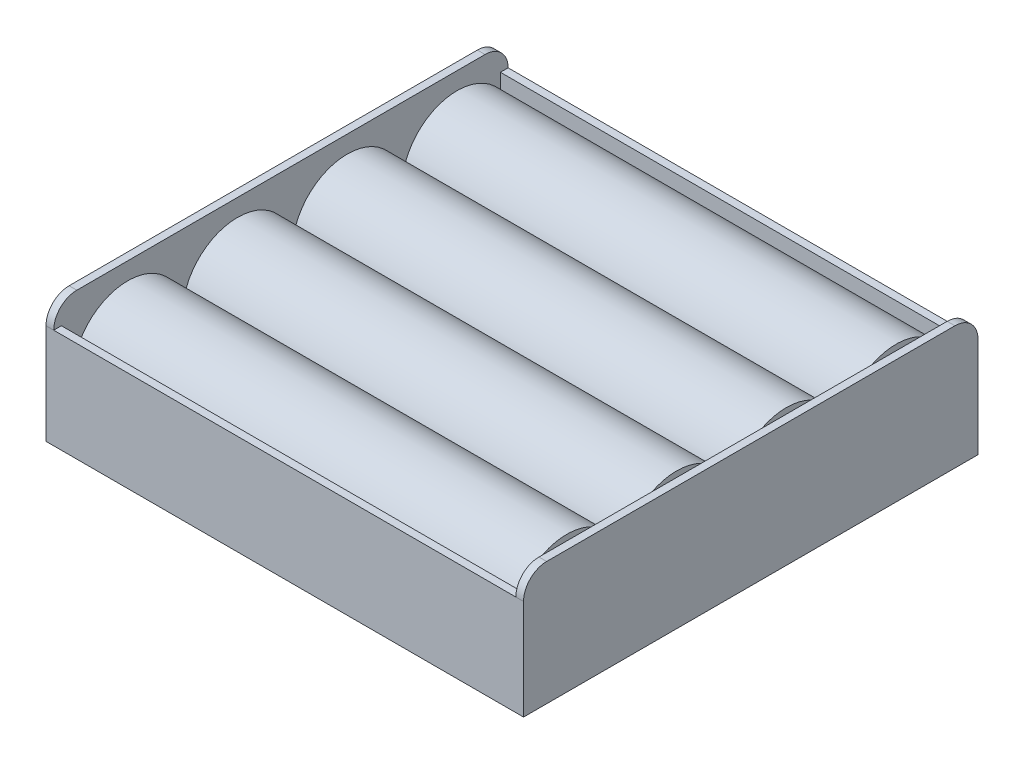
ISO-10303-21;
HEADER;
FILE_DESCRIPTION(('STEP AP214'),'2;1');
FILE_NAME('part.step','',(''),(''),'','','');
FILE_SCHEMA(('AUTOMOTIVE_DESIGN { 1 0 10303 214 1 1 1 1 }'));
ENDSEC;
DATA;
#1=APPLICATION_CONTEXT('core data for automotive mechanical design processes');
#2=APPLICATION_PROTOCOL_DEFINITION('international standard','automotive_design',2000,#1);
#3=PRODUCT_CONTEXT('',#1,'mechanical');
#4=PRODUCT('Part','Part','',(#3));
#5=PRODUCT_RELATED_PRODUCT_CATEGORY('part','',(#4));
#6=PRODUCT_DEFINITION_FORMATION('','',#4);
#7=PRODUCT_DEFINITION_CONTEXT('part definition',#1,'design');
#8=PRODUCT_DEFINITION('design','',#6,#7);
#9=PRODUCT_DEFINITION_SHAPE('','',#8);
#10=(LENGTH_UNIT() NAMED_UNIT(*) SI_UNIT(.MILLI.,.METRE.));
#11=(NAMED_UNIT(*) PLANE_ANGLE_UNIT() SI_UNIT($,.RADIAN.));
#12=(NAMED_UNIT(*) SI_UNIT($,.STERADIAN.) SOLID_ANGLE_UNIT());
#13=UNCERTAINTY_MEASURE_WITH_UNIT(LENGTH_MEASURE(1.E-05),#10,'distance_accuracy_value','');
#14=(GEOMETRIC_REPRESENTATION_CONTEXT(3) GLOBAL_UNCERTAINTY_ASSIGNED_CONTEXT((#13)) GLOBAL_UNIT_ASSIGNED_CONTEXT((#10,
#11,#12)) REPRESENTATION_CONTEXT('',''));
#15=CARTESIAN_POINT('',(0.,0.,0.));
#16=DIRECTION('',(0.,0.,1.));
#17=DIRECTION('',(1.,0.,0.));
#18=AXIS2_PLACEMENT_3D('',#15,#16,#17);
#19=CARTESIAN_POINT('',(28.5,8.125,-21.375));
#20=DIRECTION('',(-1.,0.,0.));
#21=DIRECTION('',(0.,0.,1.));
#22=AXIS2_PLACEMENT_3D('',#19,#20,#21);
#23=CYLINDRICAL_SURFACE('',#22,7.125);
#24=CARTESIAN_POINT('',(28.5,8.125,-21.375));
#25=DIRECTION('',(1.,0.,0.));
#26=DIRECTION('',(0.,0.,-1.));
#27=AXIS2_PLACEMENT_3D('',#24,#25,#26);
#28=CIRCLE('',#27,7.125);
#29=CARTESIAN_POINT('',(28.5,8.125,-14.25));
#30=VERTEX_POINT('',#29);
#31=EDGE_CURVE('E12',#30,#30,#28,.T.);
#32=CARTESIAN_POINT('',(-28.5,8.125,-21.375));
#33=DIRECTION('',(1.,0.,0.));
#34=DIRECTION('',(0.,0.,-1.));
#35=AXIS2_PLACEMENT_3D('',#32,#33,#34);
#36=CIRCLE('',#35,7.125);
#37=CARTESIAN_POINT('',(-28.5,8.125,-14.25));
#38=VERTEX_POINT('',#37);
#39=EDGE_CURVE('E57',#38,#38,#36,.T.);
#40=CARTESIAN_POINT('',(28.5,8.125,-14.25));
#41=CARTESIAN_POINT('',(27.90625,8.125,-14.25));
#42=CARTESIAN_POINT('',(27.3125,8.125,-14.25));
#43=CARTESIAN_POINT('',(26.125,8.125,-14.25));
#44=CARTESIAN_POINT('',(25.53125,8.125,-14.25));
#45=CARTESIAN_POINT('',(24.34375,8.125,-14.25));
#46=CARTESIAN_POINT('',(23.75,8.125,-14.25));
#47=CARTESIAN_POINT('',(22.5625,8.125,-14.25));
#48=CARTESIAN_POINT('',(21.96875,8.125,-14.25));
#49=CARTESIAN_POINT('',(20.78125,8.125,-14.25));
#50=CARTESIAN_POINT('',(20.1875,8.125,-14.25));
#51=CARTESIAN_POINT('',(19.,8.125,-14.25));
#52=CARTESIAN_POINT('',(18.40625,8.125,-14.25));
#53=CARTESIAN_POINT('',(17.21875,8.125,-14.25));
#54=CARTESIAN_POINT('',(16.625,8.125,-14.25));
#55=CARTESIAN_POINT('',(15.4375,8.125,-14.25));
#56=CARTESIAN_POINT('',(14.84375,8.125,-14.25));
#57=CARTESIAN_POINT('',(13.65625,8.125,-14.25));
#58=CARTESIAN_POINT('',(13.0625,8.125,-14.25));
#59=CARTESIAN_POINT('',(11.875,8.125,-14.25));
#60=CARTESIAN_POINT('',(11.28125,8.125,-14.25));
#61=CARTESIAN_POINT('',(10.09375,8.125,-14.25));
#62=CARTESIAN_POINT('',(9.5,8.125,-14.25));
#63=CARTESIAN_POINT('',(8.3125,8.125,-14.25));
#64=CARTESIAN_POINT('',(7.71875,8.125,-14.25));
#65=CARTESIAN_POINT('',(6.53125,8.125,-14.25));
#66=CARTESIAN_POINT('',(5.9375,8.125,-14.25));
#67=CARTESIAN_POINT('',(4.75,8.125,-14.25));
#68=CARTESIAN_POINT('',(4.15625,8.125,-14.25));
#69=CARTESIAN_POINT('',(2.96875,8.125,-14.25));
#70=CARTESIAN_POINT('',(2.375,8.125,-14.25));
#71=CARTESIAN_POINT('',(1.1875,8.125,-14.25));
#72=CARTESIAN_POINT('',(0.593750000000001,8.125,-14.25));
#73=CARTESIAN_POINT('',(-0.593750000000001,8.125,-14.25));
#74=CARTESIAN_POINT('',(-1.1875,8.125,-14.25));
#75=CARTESIAN_POINT('',(-2.375,8.125,-14.25));
#76=CARTESIAN_POINT('',(-2.96875,8.125,-14.25));
#77=CARTESIAN_POINT('',(-4.15625,8.125,-14.25));
#78=CARTESIAN_POINT('',(-4.75,8.125,-14.25));
#79=CARTESIAN_POINT('',(-5.9375,8.125,-14.25));
#80=CARTESIAN_POINT('',(-6.53125,8.125,-14.25));
#81=CARTESIAN_POINT('',(-7.71875,8.125,-14.25));
#82=CARTESIAN_POINT('',(-8.3125,8.125,-14.25));
#83=CARTESIAN_POINT('',(-9.5,8.125,-14.25));
#84=CARTESIAN_POINT('',(-10.09375,8.125,-14.25));
#85=CARTESIAN_POINT('',(-11.28125,8.125,-14.25));
#86=CARTESIAN_POINT('',(-11.875,8.125,-14.25));
#87=CARTESIAN_POINT('',(-13.0625,8.125,-14.25));
#88=CARTESIAN_POINT('',(-13.65625,8.125,-14.25));
#89=CARTESIAN_POINT('',(-14.84375,8.125,-14.25));
#90=CARTESIAN_POINT('',(-15.4375,8.125,-14.25));
#91=CARTESIAN_POINT('',(-16.625,8.125,-14.25));
#92=CARTESIAN_POINT('',(-17.21875,8.125,-14.25));
#93=CARTESIAN_POINT('',(-18.40625,8.125,-14.25));
#94=CARTESIAN_POINT('',(-19.,8.125,-14.25));
#95=CARTESIAN_POINT('',(-20.1875,8.125,-14.25));
#96=CARTESIAN_POINT('',(-20.78125,8.125,-14.25));
#97=CARTESIAN_POINT('',(-21.96875,8.125,-14.25));
#98=CARTESIAN_POINT('',(-22.5625,8.125,-14.25));
#99=CARTESIAN_POINT('',(-23.75,8.125,-14.25));
#100=CARTESIAN_POINT('',(-24.34375,8.125,-14.25));
#101=CARTESIAN_POINT('',(-25.53125,8.125,-14.25));
#102=CARTESIAN_POINT('',(-26.125,8.125,-14.25));
#103=CARTESIAN_POINT('',(-27.3125,8.125,-14.25));
#104=CARTESIAN_POINT('',(-27.90625,8.125,-14.25));
#105=CARTESIAN_POINT('',(-28.5,8.125,-14.25));
#106=B_SPLINE_CURVE_WITH_KNOTS('',3,(#40,#41,#42,#43,#44,#45,#46,#47,#48,#49,#50,#51,#52,#53,
#54,#55,#56,#57,#58,#59,#60,#61,#62,#63,#64,#65,#66,#67,#68,#69,#70,#71,#72,#73,#74,#75,#76,#77,
#78,#79,#80,#81,#82,#83,#84,#85,#86,#87,#88,#89,#90,#91,#92,#93,#94,#95,#96,#97,#98,#99,#100,
#101,#102,#103,#104,#105),.UNSPECIFIED.,.F.,.F.,(4,2,2,2,2,2,2,2,2,2,2,2,2,2,2,2,2,2,2,2,2,2,2,
2,2,2,2,2,2,2,2,2,4),(0.,1.78125,3.5625,5.34375,7.125,8.90625,10.6875,12.46875,14.25,16.03125,
17.8125,19.59375,21.375,23.15625,24.9375,26.71875,28.5,30.28125,32.0625,33.84375,35.625,
37.40625,39.1875,40.96875,42.75,44.53125,46.3125,48.09375,49.875,51.65625,53.4375,55.21875,57.),.UNSPECIFIED.);
#107=EDGE_CURVE('BSEAM54',#30,#38,#106,.T.);
#108=ORIENTED_EDGE('',*,*,#31,.F.);
#109=ORIENTED_EDGE('',*,*,#39,.T.);
#110=ORIENTED_EDGE('',*,*,#107,.T.);
#111=ORIENTED_EDGE('',*,*,#107,.F.);
#112=EDGE_LOOP('',(#108,#110,#109,#111));
#113=FACE_BOUND('',#112,.T.);
#114=ADVANCED_FACE('F54',(#113),#23,.T.);
#115=CARTESIAN_POINT('',(28.5,8.125,-45.8415068320873));
#116=DIRECTION('',(1.,0.,0.));
#117=DIRECTION('',(0.,0.,-1.));
#118=AXIS2_PLACEMENT_3D('',#115,#116,#117);
#119=PLANE('',#118);
#120=ORIENTED_EDGE('',*,*,#31,.T.);
#121=EDGE_LOOP('',(#120));
#122=FACE_BOUND('',#121,.T.);
#123=ADVANCED_FACE('F69',(#122),#119,.T.);
#124=CARTESIAN_POINT('',(-28.5,8.125,-45.8415068320873));
#125=DIRECTION('',(1.,0.,0.));
#126=DIRECTION('',(0.,0.,-1.));
#127=AXIS2_PLACEMENT_3D('',#124,#125,#126);
#128=PLANE('',#127);
#129=ORIENTED_EDGE('',*,*,#39,.F.);
#130=EDGE_LOOP('',(#129));
#131=FACE_BOUND('',#130,.T.);
#132=ADVANCED_FACE('F67',(#131),#128,.F.);
#133=CLOSED_SHELL('',(#114,#123,#132));
#134=MANIFOLD_SOLID_BREP('B2',#133);
#135=CARTESIAN_POINT('',(28.5,8.125,-7.125));
#136=DIRECTION('',(-1.,0.,0.));
#137=DIRECTION('',(0.,0.,1.));
#138=AXIS2_PLACEMENT_3D('',#135,#136,#137);
#139=CYLINDRICAL_SURFACE('',#138,7.125);
#140=CARTESIAN_POINT('',(-28.5,8.125,-7.125));
#141=DIRECTION('',(1.,0.,0.));
#142=DIRECTION('',(0.,0.,-1.));
#143=AXIS2_PLACEMENT_3D('',#140,#141,#142);
#144=CIRCLE('',#143,7.125);
#145=CARTESIAN_POINT('',(-28.5,8.125,-14.25));
#146=VERTEX_POINT('',#145);
#147=CARTESIAN_POINT('',(-28.5,8.125,0.));
#148=VERTEX_POINT('',#147);
#149=EDGE_CURVE('E136',#146,#148,#144,.T.);
#150=ORIENTED_EDGE('',*,*,#149,.T.);
#151=DIRECTION('',(-1.,0.,0.));
#152=VECTOR('',#151,1.);
#153=CARTESIAN_POINT('',(28.5,8.125,0.));
#154=LINE('',#153,#152);
#155=CARTESIAN_POINT('',(28.5,8.125,0.));
#156=VERTEX_POINT('',#155);
#157=EDGE_CURVE('E52',#156,#148,#154,.T.);
#158=ORIENTED_EDGE('',*,*,#157,.F.);
#159=CARTESIAN_POINT('',(28.5,8.125,-7.125));
#160=DIRECTION('',(1.,0.,0.));
#161=DIRECTION('',(0.,0.,-1.));
#162=AXIS2_PLACEMENT_3D('',#159,#160,#161);
#163=CIRCLE('',#162,7.125);
#164=CARTESIAN_POINT('',(28.5,8.125,-14.25));
#165=VERTEX_POINT('',#164);
#166=EDGE_CURVE('E135',#165,#156,#163,.T.);
#167=ORIENTED_EDGE('',*,*,#166,.F.);
#168=DIRECTION('',(-1.,0.,0.));
#169=VECTOR('',#168,1.);
#170=CARTESIAN_POINT('',(28.5,8.125,-14.25));
#171=LINE('',#170,#169);
#172=EDGE_CURVE('E113',#165,#146,#171,.T.);
#173=ORIENTED_EDGE('',*,*,#172,.T.);
#174=EDGE_LOOP('',(#150,#158,#167,#173));
#175=FACE_BOUND('',#174,.T.);
#176=ADVANCED_FACE('F105',(#175),#139,.T.);
#177=CARTESIAN_POINT('',(28.5,8.125,-45.8415068320873));
#178=DIRECTION('',(0.,1.,0.));
#179=DIRECTION('',(0.,0.,1.));
#180=AXIS2_PLACEMENT_3D('',#177,#178,#179);
#181=PLANE('',#180);
#182=DIRECTION('',(0.,0.,-1.));
#183=VECTOR('',#182,1.);
#184=CARTESIAN_POINT('',(-28.5,8.125,-45.8415068320873));
#185=LINE('',#184,#183);
#186=EDGE_CURVE('E128',#148,#146,#185,.T.);
#187=ORIENTED_EDGE('',*,*,#186,.T.);
#188=ORIENTED_EDGE('',*,*,#172,.F.);
#189=DIRECTION('',(0.,0.,-1.));
#190=VECTOR('',#189,1.);
#191=CARTESIAN_POINT('',(28.5,8.125,-45.8415068320873));
#192=LINE('',#191,#190);
#193=EDGE_CURVE('E120',#156,#165,#192,.T.);
#194=ORIENTED_EDGE('',*,*,#193,.F.);
#195=ORIENTED_EDGE('',*,*,#157,.T.);
#196=EDGE_LOOP('',(#187,#188,#194,#195));
#197=FACE_BOUND('',#196,.T.);
#198=ADVANCED_FACE('F131',(#197),#181,.F.);
#199=CARTESIAN_POINT('',(28.5,8.125,-45.8415068320873));
#200=DIRECTION('',(1.,0.,0.));
#201=DIRECTION('',(0.,0.,-1.));
#202=AXIS2_PLACEMENT_3D('',#199,#200,#201);
#203=PLANE('',#202);
#204=ORIENTED_EDGE('',*,*,#166,.T.);
#205=ORIENTED_EDGE('',*,*,#193,.T.);
#206=EDGE_LOOP('',(#204,#205));
#207=FACE_BOUND('',#206,.T.);
#208=ADVANCED_FACE('F143',(#207),#203,.T.);
#209=CARTESIAN_POINT('',(-28.5,8.125,-45.8415068320873));
#210=DIRECTION('',(1.,0.,0.));
#211=DIRECTION('',(0.,0.,-1.));
#212=AXIS2_PLACEMENT_3D('',#209,#210,#211);
#213=PLANE('',#212);
#214=ORIENTED_EDGE('',*,*,#149,.F.);
#215=ORIENTED_EDGE('',*,*,#186,.F.);
#216=EDGE_LOOP('',(#214,#215));
#217=FACE_BOUND('',#216,.T.);
#218=ADVANCED_FACE('F139',(#217),#213,.F.);
#219=CLOSED_SHELL('',(#176,#198,#208,#218));
#220=MANIFOLD_SOLID_BREP('B7',#219);
#221=CARTESIAN_POINT('',(28.5,8.125,7.125));
#222=DIRECTION('',(-1.,0.,0.));
#223=DIRECTION('',(0.,0.,1.));
#224=AXIS2_PLACEMENT_3D('',#221,#222,#223);
#225=CYLINDRICAL_SURFACE('',#224,7.125);
#226=CARTESIAN_POINT('',(-28.5,8.125,7.125));
#227=DIRECTION('',(1.,0.,0.));
#228=DIRECTION('',(0.,0.,-1.));
#229=AXIS2_PLACEMENT_3D('',#226,#227,#228);
#230=CIRCLE('',#229,7.125);
#231=CARTESIAN_POINT('',(-28.5,8.125,0.));
#232=VERTEX_POINT('',#231);
#233=CARTESIAN_POINT('',(-28.5,8.125,14.25));
#234=VERTEX_POINT('',#233);
#235=EDGE_CURVE('E216',#232,#234,#230,.T.);
#236=ORIENTED_EDGE('',*,*,#235,.T.);
#237=DIRECTION('',(-1.,0.,0.));
#238=VECTOR('',#237,1.);
#239=CARTESIAN_POINT('',(28.5,8.125,14.25));
#240=LINE('',#239,#238);
#241=CARTESIAN_POINT('',(28.5,8.125,14.25));
#242=VERTEX_POINT('',#241);
#243=EDGE_CURVE('E103',#242,#234,#240,.T.);
#244=ORIENTED_EDGE('',*,*,#243,.F.);
#245=CARTESIAN_POINT('',(28.5,8.125,7.125));
#246=DIRECTION('',(1.,0.,0.));
#247=DIRECTION('',(0.,0.,-1.));
#248=AXIS2_PLACEMENT_3D('',#245,#246,#247);
#249=CIRCLE('',#248,7.125);
#250=CARTESIAN_POINT('',(28.5,8.125,0.));
#251=VERTEX_POINT('',#250);
#252=EDGE_CURVE('E215',#251,#242,#249,.T.);
#253=ORIENTED_EDGE('',*,*,#252,.F.);
#254=DIRECTION('',(-1.,0.,0.));
#255=VECTOR('',#254,1.);
#256=CARTESIAN_POINT('',(28.5,8.125,0.));
#257=LINE('',#256,#255);
#258=EDGE_CURVE('E193',#251,#232,#257,.T.);
#259=ORIENTED_EDGE('',*,*,#258,.T.);
#260=EDGE_LOOP('',(#236,#244,#253,#259));
#261=FACE_BOUND('',#260,.T.);
#262=ADVANCED_FACE('F185',(#261),#225,.T.);
#263=CARTESIAN_POINT('',(28.5,8.125,-45.8415068320873));
#264=DIRECTION('',(0.,1.,0.));
#265=DIRECTION('',(0.,0.,1.));
#266=AXIS2_PLACEMENT_3D('',#263,#264,#265);
#267=PLANE('',#266);
#268=DIRECTION('',(0.,0.,-1.));
#269=VECTOR('',#268,1.);
#270=CARTESIAN_POINT('',(-28.5,8.125,-45.8415068320873));
#271=LINE('',#270,#269);
#272=EDGE_CURVE('E208',#234,#232,#271,.T.);
#273=ORIENTED_EDGE('',*,*,#272,.T.);
#274=ORIENTED_EDGE('',*,*,#258,.F.);
#275=DIRECTION('',(0.,0.,-1.));
#276=VECTOR('',#275,1.);
#277=CARTESIAN_POINT('',(28.5,8.125,-45.8415068320873));
#278=LINE('',#277,#276);
#279=EDGE_CURVE('E200',#242,#251,#278,.T.);
#280=ORIENTED_EDGE('',*,*,#279,.F.);
#281=ORIENTED_EDGE('',*,*,#243,.T.);
#282=EDGE_LOOP('',(#273,#274,#280,#281));
#283=FACE_BOUND('',#282,.T.);
#284=ADVANCED_FACE('F211',(#283),#267,.F.);
#285=CARTESIAN_POINT('',(28.5,8.125,-45.8415068320873));
#286=DIRECTION('',(1.,0.,0.));
#287=DIRECTION('',(0.,0.,-1.));
#288=AXIS2_PLACEMENT_3D('',#285,#286,#287);
#289=PLANE('',#288);
#290=ORIENTED_EDGE('',*,*,#252,.T.);
#291=ORIENTED_EDGE('',*,*,#279,.T.);
#292=EDGE_LOOP('',(#290,#291));
#293=FACE_BOUND('',#292,.T.);
#294=ADVANCED_FACE('F223',(#293),#289,.T.);
#295=CARTESIAN_POINT('',(-28.5,8.125,-45.8415068320873));
#296=DIRECTION('',(1.,0.,0.));
#297=DIRECTION('',(0.,0.,-1.));
#298=AXIS2_PLACEMENT_3D('',#295,#296,#297);
#299=PLANE('',#298);
#300=ORIENTED_EDGE('',*,*,#235,.F.);
#301=ORIENTED_EDGE('',*,*,#272,.F.);
#302=EDGE_LOOP('',(#300,#301));
#303=FACE_BOUND('',#302,.T.);
#304=ADVANCED_FACE('F219',(#303),#299,.F.);
#305=CLOSED_SHELL('',(#262,#284,#294,#304));
#306=MANIFOLD_SOLID_BREP('B46',#305);
#307=CARTESIAN_POINT('',(28.5,8.125,21.375));
#308=DIRECTION('',(-1.,0.,0.));
#309=DIRECTION('',(0.,0.,1.));
#310=AXIS2_PLACEMENT_3D('',#307,#308,#309);
#311=CYLINDRICAL_SURFACE('',#310,7.125);
#312=CARTESIAN_POINT('',(28.5,8.125,21.375));
#313=DIRECTION('',(1.,0.,0.));
#314=DIRECTION('',(0.,0.,-1.));
#315=AXIS2_PLACEMENT_3D('',#312,#313,#314);
#316=CIRCLE('',#315,7.125);
#317=CARTESIAN_POINT('',(28.5,8.125,28.5));
#318=VERTEX_POINT('',#317);
#319=EDGE_CURVE('E184',#318,#318,#316,.T.);
#320=CARTESIAN_POINT('',(-28.5,8.125,21.375));
#321=DIRECTION('',(1.,0.,0.));
#322=DIRECTION('',(0.,0.,-1.));
#323=AXIS2_PLACEMENT_3D('',#320,#321,#322);
#324=CIRCLE('',#323,7.125);
#325=CARTESIAN_POINT('',(-28.5,8.125,28.5));
#326=VERTEX_POINT('',#325);
#327=EDGE_CURVE('E269',#326,#326,#324,.T.);
#328=CARTESIAN_POINT('',(28.5,8.125,28.5));
#329=CARTESIAN_POINT('',(27.90625,8.125,28.5));
#330=CARTESIAN_POINT('',(27.3125,8.125,28.5));
#331=CARTESIAN_POINT('',(26.125,8.125,28.5));
#332=CARTESIAN_POINT('',(25.53125,8.125,28.5));
#333=CARTESIAN_POINT('',(24.34375,8.125,28.5));
#334=CARTESIAN_POINT('',(23.75,8.125,28.5));
#335=CARTESIAN_POINT('',(22.5625,8.125,28.5));
#336=CARTESIAN_POINT('',(21.96875,8.125,28.5));
#337=CARTESIAN_POINT('',(20.78125,8.125,28.5));
#338=CARTESIAN_POINT('',(20.1875,8.125,28.5));
#339=CARTESIAN_POINT('',(19.,8.125,28.5));
#340=CARTESIAN_POINT('',(18.40625,8.125,28.5));
#341=CARTESIAN_POINT('',(17.21875,8.125,28.5));
#342=CARTESIAN_POINT('',(16.625,8.125,28.5));
#343=CARTESIAN_POINT('',(15.4375,8.125,28.5));
#344=CARTESIAN_POINT('',(14.84375,8.125,28.5));
#345=CARTESIAN_POINT('',(13.65625,8.125,28.5));
#346=CARTESIAN_POINT('',(13.0625,8.125,28.5));
#347=CARTESIAN_POINT('',(11.875,8.125,28.5));
#348=CARTESIAN_POINT('',(11.28125,8.125,28.5));
#349=CARTESIAN_POINT('',(10.09375,8.125,28.5));
#350=CARTESIAN_POINT('',(9.5,8.125,28.5));
#351=CARTESIAN_POINT('',(8.3125,8.125,28.5));
#352=CARTESIAN_POINT('',(7.71875,8.125,28.5));
#353=CARTESIAN_POINT('',(6.53125,8.125,28.5));
#354=CARTESIAN_POINT('',(5.9375,8.125,28.5));
#355=CARTESIAN_POINT('',(4.75,8.125,28.5));
#356=CARTESIAN_POINT('',(4.15625,8.125,28.5));
#357=CARTESIAN_POINT('',(2.96875,8.125,28.5));
#358=CARTESIAN_POINT('',(2.375,8.125,28.5));
#359=CARTESIAN_POINT('',(1.1875,8.125,28.5));
#360=CARTESIAN_POINT('',(0.593750000000001,8.125,28.5));
#361=CARTESIAN_POINT('',(-0.593750000000001,8.125,28.5));
#362=CARTESIAN_POINT('',(-1.1875,8.125,28.5));
#363=CARTESIAN_POINT('',(-2.375,8.125,28.5));
#364=CARTESIAN_POINT('',(-2.96875,8.125,28.5));
#365=CARTESIAN_POINT('',(-4.15625,8.125,28.5));
#366=CARTESIAN_POINT('',(-4.75,8.125,28.5));
#367=CARTESIAN_POINT('',(-5.9375,8.125,28.5));
#368=CARTESIAN_POINT('',(-6.53125,8.125,28.5));
#369=CARTESIAN_POINT('',(-7.71875,8.125,28.5));
#370=CARTESIAN_POINT('',(-8.3125,8.125,28.5));
#371=CARTESIAN_POINT('',(-9.5,8.125,28.5));
#372=CARTESIAN_POINT('',(-10.09375,8.125,28.5));
#373=CARTESIAN_POINT('',(-11.28125,8.125,28.5));
#374=CARTESIAN_POINT('',(-11.875,8.125,28.5));
#375=CARTESIAN_POINT('',(-13.0625,8.125,28.5));
#376=CARTESIAN_POINT('',(-13.65625,8.125,28.5));
#377=CARTESIAN_POINT('',(-14.84375,8.125,28.5));
#378=CARTESIAN_POINT('',(-15.4375,8.125,28.5));
#379=CARTESIAN_POINT('',(-16.625,8.125,28.5));
#380=CARTESIAN_POINT('',(-17.21875,8.125,28.5));
#381=CARTESIAN_POINT('',(-18.40625,8.125,28.5));
#382=CARTESIAN_POINT('',(-19.,8.125,28.5));
#383=CARTESIAN_POINT('',(-20.1875,8.125,28.5));
#384=CARTESIAN_POINT('',(-20.78125,8.125,28.5));
#385=CARTESIAN_POINT('',(-21.96875,8.125,28.5));
#386=CARTESIAN_POINT('',(-22.5625,8.125,28.5));
#387=CARTESIAN_POINT('',(-23.75,8.125,28.5));
#388=CARTESIAN_POINT('',(-24.34375,8.125,28.5));
#389=CARTESIAN_POINT('',(-25.53125,8.125,28.5));
#390=CARTESIAN_POINT('',(-26.125,8.125,28.5));
#391=CARTESIAN_POINT('',(-27.3125,8.125,28.5));
#392=CARTESIAN_POINT('',(-27.90625,8.125,28.5));
#393=CARTESIAN_POINT('',(-28.5,8.125,28.5));
#394=B_SPLINE_CURVE_WITH_KNOTS('',3,(#328,#329,#330,#331,#332,#333,#334,#335,#336,#337,#338,
#339,#340,#341,#342,#343,#344,#345,#346,#347,#348,#349,#350,#351,#352,#353,#354,#355,#356,#357,
#358,#359,#360,#361,#362,#363,#364,#365,#366,#367,#368,#369,#370,#371,#372,#373,#374,#375,#376,
#377,#378,#379,#380,#381,#382,#383,#384,#385,#386,#387,#388,#389,#390,#391,#392,#393),
.UNSPECIFIED.,.F.,.F.,(4,2,2,2,2,2,2,2,2,2,2,2,2,2,2,2,2,2,2,2,2,2,2,2,2,2,2,2,2,2,2,2,4),(0.,
1.78125,3.5625,5.34375,7.125,8.90625,10.6875,12.46875,14.25,16.03125,17.8125,19.59375,21.375,
23.15625,24.9375,26.71875,28.5,30.28125,32.0625,33.84375,35.625,37.40625,39.1875,40.96875,42.75,
44.53125,46.3125,48.09375,49.875,51.65625,53.4375,55.21875,57.),.UNSPECIFIED.);
#395=EDGE_CURVE('BSEAM266',#318,#326,#394,.T.);
#396=ORIENTED_EDGE('',*,*,#319,.F.);
#397=ORIENTED_EDGE('',*,*,#327,.T.);
#398=ORIENTED_EDGE('',*,*,#395,.T.);
#399=ORIENTED_EDGE('',*,*,#395,.F.);
#400=EDGE_LOOP('',(#396,#398,#397,#399));
#401=FACE_BOUND('',#400,.T.);
#402=ADVANCED_FACE('F266',(#401),#311,.T.);
#403=CARTESIAN_POINT('',(28.5,8.125,-45.8415068320873));
#404=DIRECTION('',(1.,0.,0.));
#405=DIRECTION('',(0.,0.,-1.));
#406=AXIS2_PLACEMENT_3D('',#403,#404,#405);
#407=PLANE('',#406);
#408=ORIENTED_EDGE('',*,*,#319,.T.);
#409=EDGE_LOOP('',(#408));
#410=FACE_BOUND('',#409,.T.);
#411=ADVANCED_FACE('F281',(#410),#407,.T.);
#412=CARTESIAN_POINT('',(-28.5,8.125,-45.8415068320873));
#413=DIRECTION('',(1.,0.,0.));
#414=DIRECTION('',(0.,0.,-1.));
#415=AXIS2_PLACEMENT_3D('',#412,#413,#414);
#416=PLANE('',#415);
#417=ORIENTED_EDGE('',*,*,#327,.F.);
#418=EDGE_LOOP('',(#417));
#419=FACE_BOUND('',#418,.T.);
#420=ADVANCED_FACE('F279',(#419),#416,.F.);
#421=CLOSED_SHELL('',(#402,#411,#420));
#422=MANIFOLD_SOLID_BREP('B97',#421);
#423=CARTESIAN_POINT('',(30.,13.,-28.5));
#424=DIRECTION('',(0.,-1.,0.));
#425=DIRECTION('',(0.,0.,-1.));
#426=AXIS2_PLACEMENT_3D('',#423,#424,#425);
#427=PLANE('',#426);
#428=DIRECTION('',(-1.,0.,0.));
#429=VECTOR('',#428,1.);
#430=CARTESIAN_POINT('',(30.,13.,-29.5));
#431=LINE('',#430,#429);
#432=CARTESIAN_POINT('',(30.,13.,-29.5));
#433=VERTEX_POINT('',#432);
#434=CARTESIAN_POINT('',(-30.,13.,-29.5));
#435=VERTEX_POINT('',#434);
#436=EDGE_CURVE('E321',#433,#435,#431,.T.);
#437=ORIENTED_EDGE('',*,*,#436,.T.);
#438=DIRECTION('',(0.,0.,1.));
#439=VECTOR('',#438,1.);
#440=CARTESIAN_POINT('',(-30.,13.,-28.5));
#441=LINE('',#440,#439);
#442=CARTESIAN_POINT('',(-30.,13.,-28.5));
#443=VERTEX_POINT('',#442);
#444=EDGE_CURVE('E423',#435,#443,#441,.T.);
#445=ORIENTED_EDGE('',*,*,#444,.T.);
#446=DIRECTION('',(-1.,0.,0.));
#447=VECTOR('',#446,1.);
#448=CARTESIAN_POINT('',(30.,13.,-28.5));
#449=LINE('',#448,#447);
#450=CARTESIAN_POINT('',(30.,13.,-28.5));
#451=VERTEX_POINT('',#450);
#452=EDGE_CURVE('E264',#451,#443,#449,.T.);
#453=ORIENTED_EDGE('',*,*,#452,.F.);
#454=DIRECTION('',(0.,0.,1.));
#455=VECTOR('',#454,1.);
#456=CARTESIAN_POINT('',(30.,13.,-28.5));
#457=LINE('',#456,#455);
#458=EDGE_CURVE('E505',#433,#451,#457,.T.);
#459=ORIENTED_EDGE('',*,*,#458,.F.);
#460=EDGE_LOOP('',(#437,#445,#453,#459));
#461=FACE_BOUND('',#460,.T.);
#462=ADVANCED_FACE('F307',(#461),#427,.F.);
#463=CARTESIAN_POINT('',(30.,0.999999999999997,-28.5));
#464=DIRECTION('',(0.,0.,-1.));
#465=DIRECTION('',(-1.,0.,0.));
#466=AXIS2_PLACEMENT_3D('',#463,#464,#465);
#467=PLANE('',#466);
#468=ORIENTED_EDGE('',*,*,#452,.T.);
#469=DIRECTION('',(0.,-1.,0.));
#470=VECTOR('',#469,1.);
#471=CARTESIAN_POINT('',(-30.,0.999999999999997,-28.5));
#472=LINE('',#471,#470);
#473=CARTESIAN_POINT('',(-30.,0.999999999999997,-28.5));
#474=VERTEX_POINT('',#473);
#475=EDGE_CURVE('E470',#443,#474,#472,.T.);
#476=ORIENTED_EDGE('',*,*,#475,.T.);
#477=DIRECTION('',(-1.,0.,0.));
#478=VECTOR('',#477,1.);
#479=CARTESIAN_POINT('',(30.,0.999999999999997,-28.5));
#480=LINE('',#479,#478);
#481=CARTESIAN_POINT('',(30.,0.999999999999997,-28.5));
#482=VERTEX_POINT('',#481);
#483=EDGE_CURVE('E314',#482,#474,#480,.T.);
#484=ORIENTED_EDGE('',*,*,#483,.F.);
#485=DIRECTION('',(0.,-1.,0.));
#486=VECTOR('',#485,1.);
#487=CARTESIAN_POINT('',(30.,0.999999999999997,-28.5));
#488=LINE('',#487,#486);
#489=EDGE_CURVE('E508',#451,#482,#488,.T.);
#490=ORIENTED_EDGE('',*,*,#489,.F.);
#491=EDGE_LOOP('',(#468,#476,#484,#490));
#492=FACE_BOUND('',#491,.T.);
#493=ADVANCED_FACE('F534',(#492),#467,.F.);
#494=CARTESIAN_POINT('',(30.,0.999999999999997,-28.5));
#495=DIRECTION('',(0.,-1.,0.));
#496=DIRECTION('',(0.,0.,-1.));
#497=AXIS2_PLACEMENT_3D('',#494,#495,#496);
#498=PLANE('',#497);
#499=ORIENTED_EDGE('',*,*,#483,.T.);
#500=DIRECTION('',(0.,0.,1.));
#501=VECTOR('',#500,1.);
#502=CARTESIAN_POINT('',(-30.,0.999999999999997,-28.5));
#503=LINE('',#502,#501);
#504=CARTESIAN_POINT('',(-30.,0.999999999999997,28.5));
#505=VERTEX_POINT('',#504);
#506=EDGE_CURVE('E467',#474,#505,#503,.T.);
#507=ORIENTED_EDGE('',*,*,#506,.T.);
#508=DIRECTION('',(-1.,0.,0.));
#509=VECTOR('',#508,1.);
#510=CARTESIAN_POINT('',(30.,0.999999999999997,28.5));
#511=LINE('',#510,#509);
#512=CARTESIAN_POINT('',(30.,0.999999999999997,28.5));
#513=VERTEX_POINT('',#512);
#514=EDGE_CURVE('E527',#513,#505,#511,.T.);
#515=ORIENTED_EDGE('',*,*,#514,.F.);
#516=DIRECTION('',(0.,0.,1.));
#517=VECTOR('',#516,1.);
#518=CARTESIAN_POINT('',(30.,0.999999999999997,-28.5));
#519=LINE('',#518,#517);
#520=EDGE_CURVE('E511',#482,#513,#519,.T.);
#521=ORIENTED_EDGE('',*,*,#520,.F.);
#522=EDGE_LOOP('',(#499,#507,#515,#521));
#523=FACE_BOUND('',#522,.T.);
#524=ADVANCED_FACE('F532',(#523),#498,.F.);
#525=CARTESIAN_POINT('',(30.,0.999999999999997,28.5));
#526=DIRECTION('',(0.,0.,1.));
#527=DIRECTION('',(1.,0.,0.));
#528=AXIS2_PLACEMENT_3D('',#525,#526,#527);
#529=PLANE('',#528);
#530=ORIENTED_EDGE('',*,*,#514,.T.);
#531=DIRECTION('',(0.,1.,0.));
#532=VECTOR('',#531,1.);
#533=CARTESIAN_POINT('',(-30.,0.999999999999997,28.5));
#534=LINE('',#533,#532);
#535=CARTESIAN_POINT('',(-30.,13.,28.5));
#536=VERTEX_POINT('',#535);
#537=EDGE_CURVE('E465',#505,#536,#534,.T.);
#538=ORIENTED_EDGE('',*,*,#537,.T.);
#539=DIRECTION('',(-1.,0.,0.));
#540=VECTOR('',#539,1.);
#541=CARTESIAN_POINT('',(30.,13.,28.5));
#542=LINE('',#541,#540);
#543=CARTESIAN_POINT('',(30.,13.,28.5));
#544=VERTEX_POINT('',#543);
#545=EDGE_CURVE('E329',#544,#536,#542,.T.);
#546=ORIENTED_EDGE('',*,*,#545,.F.);
#547=DIRECTION('',(0.,1.,0.));
#548=VECTOR('',#547,1.);
#549=CARTESIAN_POINT('',(30.,0.999999999999997,28.5));
#550=LINE('',#549,#548);
#551=EDGE_CURVE('E514',#513,#544,#550,.T.);
#552=ORIENTED_EDGE('',*,*,#551,.F.);
#553=EDGE_LOOP('',(#530,#538,#546,#552));
#554=FACE_BOUND('',#553,.T.);
#555=ADVANCED_FACE('F538',(#554),#529,.F.);
#556=CARTESIAN_POINT('',(30.,13.,28.5));
#557=DIRECTION('',(0.,-1.,0.));
#558=DIRECTION('',(0.,0.,-1.));
#559=AXIS2_PLACEMENT_3D('',#556,#557,#558);
#560=PLANE('',#559);
#561=ORIENTED_EDGE('',*,*,#545,.T.);
#562=DIRECTION('',(0.,0.,1.));
#563=VECTOR('',#562,1.);
#564=CARTESIAN_POINT('',(-30.,13.,28.5));
#565=LINE('',#564,#563);
#566=CARTESIAN_POINT('',(-30.,13.,29.5));
#567=VERTEX_POINT('',#566);
#568=EDGE_CURVE('E463',#536,#567,#565,.T.);
#569=ORIENTED_EDGE('',*,*,#568,.T.);
#570=DIRECTION('',(-1.,0.,0.));
#571=VECTOR('',#570,1.);
#572=CARTESIAN_POINT('',(30.,13.,29.5));
#573=LINE('',#572,#571);
#574=CARTESIAN_POINT('',(30.,13.,29.5));
#575=VERTEX_POINT('',#574);
#576=EDGE_CURVE('E417',#575,#567,#573,.T.);
#577=ORIENTED_EDGE('',*,*,#576,.F.);
#578=DIRECTION('',(0.,0.,1.));
#579=VECTOR('',#578,1.);
#580=CARTESIAN_POINT('',(30.,13.,28.5));
#581=LINE('',#580,#579);
#582=EDGE_CURVE('E517',#544,#575,#581,.T.);
#583=ORIENTED_EDGE('',*,*,#582,.F.);
#584=EDGE_LOOP('',(#561,#569,#577,#583));
#585=FACE_BOUND('',#584,.T.);
#586=ADVANCED_FACE('F573',(#585),#560,.F.);
#587=CARTESIAN_POINT('',(30.,13.,29.5));
#588=DIRECTION('',(0.,0.,-1.));
#589=DIRECTION('',(-1.,0.,0.));
#590=AXIS2_PLACEMENT_3D('',#587,#588,#589);
#591=PLANE('',#590);
#592=ORIENTED_EDGE('',*,*,#576,.T.);
#593=DIRECTION('',(1.,0.,0.));
#594=VECTOR('',#593,1.);
#595=CARTESIAN_POINT('',(-31.,13.,29.5));
#596=LINE('',#595,#594);
#597=CARTESIAN_POINT('',(-31.,13.,29.5));
#598=VERTEX_POINT('',#597);
#599=EDGE_CURVE('E411',#598,#567,#596,.T.);
#600=ORIENTED_EDGE('',*,*,#599,.F.);
#601=DIRECTION('',(0.,-1.,0.));
#602=VECTOR('',#601,1.);
#603=CARTESIAN_POINT('',(-31.,0.,29.5));
#604=LINE('',#603,#602);
#605=CARTESIAN_POINT('',(-31.,0.,29.5));
#606=VERTEX_POINT('',#605);
#607=EDGE_CURVE('E414',#598,#606,#604,.T.);
#608=ORIENTED_EDGE('',*,*,#607,.T.);
#609=DIRECTION('',(-1.,0.,0.));
#610=VECTOR('',#609,1.);
#611=CARTESIAN_POINT('',(30.,0.,29.5));
#612=LINE('',#611,#610);
#613=CARTESIAN_POINT('',(31.,0.,29.5));
#614=VERTEX_POINT('',#613);
#615=EDGE_CURVE('E523',#614,#606,#612,.T.);
#616=ORIENTED_EDGE('',*,*,#615,.F.);
#617=DIRECTION('',(0.,-1.,0.));
#618=VECTOR('',#617,1.);
#619=CARTESIAN_POINT('',(31.,0.,29.5));
#620=LINE('',#619,#618);
#621=CARTESIAN_POINT('',(31.,13.,29.5));
#622=VERTEX_POINT('',#621);
#623=EDGE_CURVE('E474',#622,#614,#620,.T.);
#624=ORIENTED_EDGE('',*,*,#623,.F.);
#625=DIRECTION('',(-1.,0.,0.));
#626=VECTOR('',#625,1.);
#627=CARTESIAN_POINT('',(31.,13.,29.5));
#628=LINE('',#627,#626);
#629=EDGE_CURVE('E489',#622,#575,#628,.T.);
#630=ORIENTED_EDGE('',*,*,#629,.T.);
#631=EDGE_LOOP('',(#592,#600,#608,#616,#624,#630));
#632=FACE_BOUND('',#631,.T.);
#633=ADVANCED_FACE('F413',(#632),#591,.F.);
#634=CARTESIAN_POINT('',(30.,0.,29.5));
#635=DIRECTION('',(0.,1.,0.));
#636=DIRECTION('',(0.,0.,1.));
#637=AXIS2_PLACEMENT_3D('',#634,#635,#636);
#638=PLANE('',#637);
#639=ORIENTED_EDGE('',*,*,#615,.T.);
#640=DIRECTION('',(0.,0.,-1.));
#641=VECTOR('',#640,1.);
#642=CARTESIAN_POINT('',(-31.,0.,29.5));
#643=LINE('',#642,#641);
#644=CARTESIAN_POINT('',(-31.,0.,-29.5));
#645=VERTEX_POINT('',#644);
#646=EDGE_CURVE('E434',#606,#645,#643,.T.);
#647=ORIENTED_EDGE('',*,*,#646,.T.);
#648=DIRECTION('',(-1.,0.,0.));
#649=VECTOR('',#648,1.);
#650=CARTESIAN_POINT('',(30.,0.,-29.5));
#651=LINE('',#650,#649);
#652=CARTESIAN_POINT('',(31.,0.,-29.5));
#653=VERTEX_POINT('',#652);
#654=EDGE_CURVE('E521',#653,#645,#651,.T.);
#655=ORIENTED_EDGE('',*,*,#654,.F.);
#656=DIRECTION('',(0.,0.,-1.));
#657=VECTOR('',#656,1.);
#658=CARTESIAN_POINT('',(31.,0.,29.5));
#659=LINE('',#658,#657);
#660=EDGE_CURVE('E477',#614,#653,#659,.T.);
#661=ORIENTED_EDGE('',*,*,#660,.F.);
#662=EDGE_LOOP('',(#639,#647,#655,#661));
#663=FACE_BOUND('',#662,.T.);
#664=ADVANCED_FACE('F565',(#663),#638,.F.);
#665=CARTESIAN_POINT('',(30.,13.,-29.5));
#666=DIRECTION('',(0.,0.,1.));
#667=DIRECTION('',(1.,0.,0.));
#668=AXIS2_PLACEMENT_3D('',#665,#666,#667);
#669=PLANE('',#668);
#670=ORIENTED_EDGE('',*,*,#654,.T.);
#671=DIRECTION('',(0.,1.,0.));
#672=VECTOR('',#671,1.);
#673=CARTESIAN_POINT('',(-31.,0.,-29.5));
#674=LINE('',#673,#672);
#675=CARTESIAN_POINT('',(-31.,13.,-29.5));
#676=VERTEX_POINT('',#675);
#677=EDGE_CURVE('E445',#645,#676,#674,.T.);
#678=ORIENTED_EDGE('',*,*,#677,.T.);
#679=DIRECTION('',(1.,0.,0.));
#680=VECTOR('',#679,1.);
#681=CARTESIAN_POINT('',(-31.,13.,-29.5));
#682=LINE('',#681,#680);
#683=EDGE_CURVE('E449',#676,#435,#682,.T.);
#684=ORIENTED_EDGE('',*,*,#683,.T.);
#685=ORIENTED_EDGE('',*,*,#436,.F.);
#686=DIRECTION('',(-1.,0.,0.));
#687=VECTOR('',#686,1.);
#688=CARTESIAN_POINT('',(31.,13.,-29.5));
#689=LINE('',#688,#687);
#690=CARTESIAN_POINT('',(31.,13.,-29.5));
#691=VERTEX_POINT('',#690);
#692=EDGE_CURVE('E502',#691,#433,#689,.T.);
#693=ORIENTED_EDGE('',*,*,#692,.F.);
#694=DIRECTION('',(0.,1.,0.));
#695=VECTOR('',#694,1.);
#696=CARTESIAN_POINT('',(31.,0.,-29.5));
#697=LINE('',#696,#695);
#698=EDGE_CURVE('E481',#653,#691,#697,.T.);
#699=ORIENTED_EDGE('',*,*,#698,.F.);
#700=EDGE_LOOP('',(#670,#678,#684,#685,#693,#699));
#701=FACE_BOUND('',#700,.T.);
#702=ADVANCED_FACE('F562',(#701),#669,.F.);
#703=CARTESIAN_POINT('',(31.,13.,-26.5));
#704=DIRECTION('',(-1.,0.,0.));
#705=DIRECTION('',(0.,0.,1.));
#706=AXIS2_PLACEMENT_3D('',#703,#704,#705);
#707=CYLINDRICAL_SURFACE('',#706,3.);
#708=CARTESIAN_POINT('',(30.,13.,-26.5));
#709=DIRECTION('',(1.,0.,0.));
#710=DIRECTION('',(0.,0.,-1.));
#711=AXIS2_PLACEMENT_3D('',#708,#709,#710);
#712=CIRCLE('',#711,3.);
#713=CARTESIAN_POINT('',(30.,16.,-26.5));
#714=VERTEX_POINT('',#713);
#715=EDGE_CURVE('E473',#433,#714,#712,.T.);
#716=ORIENTED_EDGE('',*,*,#715,.T.);
#717=DIRECTION('',(-1.,0.,0.));
#718=VECTOR('',#717,1.);
#719=CARTESIAN_POINT('',(31.,16.,-26.5));
#720=LINE('',#719,#718);
#721=CARTESIAN_POINT('',(31.,16.,-26.5));
#722=VERTEX_POINT('',#721);
#723=EDGE_CURVE('E499',#722,#714,#720,.T.);
#724=ORIENTED_EDGE('',*,*,#723,.F.);
#725=CARTESIAN_POINT('',(31.,13.,-26.5));
#726=DIRECTION('',(1.,0.,0.));
#727=DIRECTION('',(0.,0.,-1.));
#728=AXIS2_PLACEMENT_3D('',#725,#726,#727);
#729=CIRCLE('',#728,3.);
#730=EDGE_CURVE('E483',#691,#722,#729,.T.);
#731=ORIENTED_EDGE('',*,*,#730,.F.);
#732=ORIENTED_EDGE('',*,*,#692,.T.);
#733=EDGE_LOOP('',(#716,#724,#731,#732));
#734=FACE_BOUND('',#733,.T.);
#735=ADVANCED_FACE('F545',(#734),#707,.T.);
#736=CARTESIAN_POINT('',(31.,16.,-26.5));
#737=DIRECTION('',(0.,-1.,0.));
#738=DIRECTION('',(0.,0.,-1.));
#739=AXIS2_PLACEMENT_3D('',#736,#737,#738);
#740=PLANE('',#739);
#741=DIRECTION('',(0.,0.,1.));
#742=VECTOR('',#741,1.);
#743=CARTESIAN_POINT('',(30.,16.,-26.5));
#744=LINE('',#743,#742);
#745=CARTESIAN_POINT('',(30.,16.,26.5));
#746=VERTEX_POINT('',#745);
#747=EDGE_CURVE('E491',#714,#746,#744,.T.);
#748=ORIENTED_EDGE('',*,*,#747,.T.);
#749=DIRECTION('',(-1.,0.,0.));
#750=VECTOR('',#749,1.);
#751=CARTESIAN_POINT('',(31.,16.,26.5));
#752=LINE('',#751,#750);
#753=CARTESIAN_POINT('',(31.,16.,26.5));
#754=VERTEX_POINT('',#753);
#755=EDGE_CURVE('E496',#754,#746,#752,.T.);
#756=ORIENTED_EDGE('',*,*,#755,.F.);
#757=DIRECTION('',(0.,0.,1.));
#758=VECTOR('',#757,1.);
#759=CARTESIAN_POINT('',(31.,16.,-26.5));
#760=LINE('',#759,#758);
#761=EDGE_CURVE('E485',#722,#754,#760,.T.);
#762=ORIENTED_EDGE('',*,*,#761,.F.);
#763=ORIENTED_EDGE('',*,*,#723,.T.);
#764=EDGE_LOOP('',(#748,#756,#762,#763));
#765=FACE_BOUND('',#764,.T.);
#766=ADVANCED_FACE('F552',(#765),#740,.F.);
#767=CARTESIAN_POINT('',(31.,13.,26.5));
#768=DIRECTION('',(-1.,0.,0.));
#769=DIRECTION('',(0.,0.,1.));
#770=AXIS2_PLACEMENT_3D('',#767,#768,#769);
#771=CYLINDRICAL_SURFACE('',#770,3.);
#772=CARTESIAN_POINT('',(30.,13.,26.5));
#773=DIRECTION('',(1.,0.,0.));
#774=DIRECTION('',(0.,0.,1.));
#775=AXIS2_PLACEMENT_3D('',#772,#773,#774);
#776=CIRCLE('',#775,3.);
#777=EDGE_CURVE('E478',#746,#575,#776,.T.);
#778=ORIENTED_EDGE('',*,*,#777,.T.);
#779=ORIENTED_EDGE('',*,*,#629,.F.);
#780=CARTESIAN_POINT('',(31.,13.,26.5));
#781=DIRECTION('',(1.,0.,0.));
#782=DIRECTION('',(0.,0.,1.));
#783=AXIS2_PLACEMENT_3D('',#780,#781,#782);
#784=CIRCLE('',#783,3.);
#785=EDGE_CURVE('E487',#754,#622,#784,.T.);
#786=ORIENTED_EDGE('',*,*,#785,.F.);
#787=ORIENTED_EDGE('',*,*,#755,.T.);
#788=EDGE_LOOP('',(#778,#779,#786,#787));
#789=FACE_BOUND('',#788,.T.);
#790=ADVANCED_FACE('F556',(#789),#771,.T.);
#791=CARTESIAN_POINT('',(31.,13.,26.5));
#792=DIRECTION('',(-1.,0.,0.));
#793=DIRECTION('',(0.,0.,1.));
#794=AXIS2_PLACEMENT_3D('',#791,#792,#793);
#795=PLANE('',#794);
#796=ORIENTED_EDGE('',*,*,#623,.T.);
#797=ORIENTED_EDGE('',*,*,#660,.T.);
#798=ORIENTED_EDGE('',*,*,#698,.T.);
#799=ORIENTED_EDGE('',*,*,#730,.T.);
#800=ORIENTED_EDGE('',*,*,#761,.T.);
#801=ORIENTED_EDGE('',*,*,#785,.T.);
#802=EDGE_LOOP('',(#796,#797,#798,#799,#800,#801));
#803=FACE_BOUND('',#802,.T.);
#804=ADVANCED_FACE('F560',(#803),#795,.F.);
#805=CARTESIAN_POINT('',(30.,13.,26.5));
#806=DIRECTION('',(-1.,0.,0.));
#807=DIRECTION('',(0.,0.,1.));
#808=AXIS2_PLACEMENT_3D('',#805,#806,#807);
#809=PLANE('',#808);
#810=ORIENTED_EDGE('',*,*,#715,.F.);
#811=ORIENTED_EDGE('',*,*,#458,.T.);
#812=ORIENTED_EDGE('',*,*,#489,.T.);
#813=ORIENTED_EDGE('',*,*,#520,.T.);
#814=ORIENTED_EDGE('',*,*,#551,.T.);
#815=ORIENTED_EDGE('',*,*,#582,.T.);
#816=ORIENTED_EDGE('',*,*,#777,.F.);
#817=ORIENTED_EDGE('',*,*,#747,.F.);
#818=EDGE_LOOP('',(#810,#811,#812,#813,#814,#815,#816,#817));
#819=FACE_BOUND('',#818,.T.);
#820=ADVANCED_FACE('F541',(#819),#809,.T.);
#821=CARTESIAN_POINT('',(-30.,13.,26.5));
#822=DIRECTION('',(1.,0.,0.));
#823=DIRECTION('',(0.,0.,1.));
#824=AXIS2_PLACEMENT_3D('',#821,#822,#823);
#825=PLANE('',#824);
#826=ORIENTED_EDGE('',*,*,#444,.F.);
#827=CARTESIAN_POINT('',(-30.,13.,-26.5));
#828=DIRECTION('',(1.,0.,0.));
#829=DIRECTION('',(0.,0.,-1.));
#830=AXIS2_PLACEMENT_3D('',#827,#828,#829);
#831=CIRCLE('',#830,3.);
#832=CARTESIAN_POINT('',(-30.,16.,-26.5));
#833=VERTEX_POINT('',#832);
#834=EDGE_CURVE('E435',#435,#833,#831,.T.);
#835=ORIENTED_EDGE('',*,*,#834,.T.);
#836=DIRECTION('',(0.,0.,1.));
#837=VECTOR('',#836,1.);
#838=CARTESIAN_POINT('',(-30.,16.,-26.5));
#839=LINE('',#838,#837);
#840=CARTESIAN_POINT('',(-30.,16.,26.5));
#841=VERTEX_POINT('',#840);
#842=EDGE_CURVE('E452',#833,#841,#839,.T.);
#843=ORIENTED_EDGE('',*,*,#842,.T.);
#844=CARTESIAN_POINT('',(-30.,13.,26.5));
#845=DIRECTION('',(1.,0.,0.));
#846=DIRECTION('',(0.,0.,1.));
#847=AXIS2_PLACEMENT_3D('',#844,#845,#846);
#848=CIRCLE('',#847,3.);
#849=EDGE_CURVE('E450',#841,#567,#848,.T.);
#850=ORIENTED_EDGE('',*,*,#849,.T.);
#851=ORIENTED_EDGE('',*,*,#568,.F.);
#852=ORIENTED_EDGE('',*,*,#537,.F.);
#853=ORIENTED_EDGE('',*,*,#506,.F.);
#854=ORIENTED_EDGE('',*,*,#475,.F.);
#855=EDGE_LOOP('',(#826,#835,#843,#850,#851,#852,#853,#854));
#856=FACE_BOUND('',#855,.T.);
#857=ADVANCED_FACE('F537',(#856),#825,.T.);
#858=CARTESIAN_POINT('',(-31.,13.,26.5));
#859=DIRECTION('',(1.,0.,0.));
#860=DIRECTION('',(0.,0.,-1.));
#861=AXIS2_PLACEMENT_3D('',#858,#859,#860);
#862=CYLINDRICAL_SURFACE('',#861,3.);
#863=ORIENTED_EDGE('',*,*,#849,.F.);
#864=DIRECTION('',(1.,0.,0.));
#865=VECTOR('',#864,1.);
#866=CARTESIAN_POINT('',(-31.,16.,26.5));
#867=LINE('',#866,#865);
#868=CARTESIAN_POINT('',(-31.,16.,26.5));
#869=VERTEX_POINT('',#868);
#870=EDGE_CURVE('E424',#869,#841,#867,.T.);
#871=ORIENTED_EDGE('',*,*,#870,.F.);
#872=CARTESIAN_POINT('',(-31.,13.,26.5));
#873=DIRECTION('',(1.,0.,0.));
#874=DIRECTION('',(0.,0.,1.));
#875=AXIS2_PLACEMENT_3D('',#872,#873,#874);
#876=CIRCLE('',#875,3.);
#877=EDGE_CURVE('E430',#869,#598,#876,.T.);
#878=ORIENTED_EDGE('',*,*,#877,.T.);
#879=ORIENTED_EDGE('',*,*,#599,.T.);
#880=EDGE_LOOP('',(#863,#871,#878,#879));
#881=FACE_BOUND('',#880,.T.);
#882=ADVANCED_FACE('F437',(#881),#862,.T.);
#883=CARTESIAN_POINT('',(-31.,16.,-26.5));
#884=DIRECTION('',(0.,1.,0.));
#885=DIRECTION('',(0.,0.,1.));
#886=AXIS2_PLACEMENT_3D('',#883,#884,#885);
#887=PLANE('',#886);
#888=ORIENTED_EDGE('',*,*,#842,.F.);
#889=DIRECTION('',(1.,0.,0.));
#890=VECTOR('',#889,1.);
#891=CARTESIAN_POINT('',(-31.,16.,-26.5));
#892=LINE('',#891,#890);
#893=CARTESIAN_POINT('',(-31.,16.,-26.5));
#894=VERTEX_POINT('',#893);
#895=EDGE_CURVE('E458',#894,#833,#892,.T.);
#896=ORIENTED_EDGE('',*,*,#895,.F.);
#897=DIRECTION('',(0.,0.,1.));
#898=VECTOR('',#897,1.);
#899=CARTESIAN_POINT('',(-31.,16.,-26.5));
#900=LINE('',#899,#898);
#901=EDGE_CURVE('E438',#894,#869,#900,.T.);
#902=ORIENTED_EDGE('',*,*,#901,.T.);
#903=ORIENTED_EDGE('',*,*,#870,.T.);
#904=EDGE_LOOP('',(#888,#896,#902,#903));
#905=FACE_BOUND('',#904,.T.);
#906=ADVANCED_FACE('F628',(#905),#887,.T.);
#907=CARTESIAN_POINT('',(-31.,13.,-26.5));
#908=DIRECTION('',(1.,0.,0.));
#909=DIRECTION('',(0.,0.,-1.));
#910=AXIS2_PLACEMENT_3D('',#907,#908,#909);
#911=CYLINDRICAL_SURFACE('',#910,3.);
#912=ORIENTED_EDGE('',*,*,#834,.F.);
#913=ORIENTED_EDGE('',*,*,#683,.F.);
#914=CARTESIAN_POINT('',(-31.,13.,-26.5));
#915=DIRECTION('',(1.,0.,0.));
#916=DIRECTION('',(0.,0.,-1.));
#917=AXIS2_PLACEMENT_3D('',#914,#915,#916);
#918=CIRCLE('',#917,3.);
#919=EDGE_CURVE('E440',#676,#894,#918,.T.);
#920=ORIENTED_EDGE('',*,*,#919,.T.);
#921=ORIENTED_EDGE('',*,*,#895,.T.);
#922=EDGE_LOOP('',(#912,#913,#920,#921));
#923=FACE_BOUND('',#922,.T.);
#924=ADVANCED_FACE('F637',(#923),#911,.T.);
#925=CARTESIAN_POINT('',(-31.,13.,26.5));
#926=DIRECTION('',(1.,0.,0.));
#927=DIRECTION('',(0.,0.,1.));
#928=AXIS2_PLACEMENT_3D('',#925,#926,#927);
#929=PLANE('',#928);
#930=ORIENTED_EDGE('',*,*,#607,.F.);
#931=ORIENTED_EDGE('',*,*,#877,.F.);
#932=ORIENTED_EDGE('',*,*,#901,.F.);
#933=ORIENTED_EDGE('',*,*,#919,.F.);
#934=ORIENTED_EDGE('',*,*,#677,.F.);
#935=ORIENTED_EDGE('',*,*,#646,.F.);
#936=EDGE_LOOP('',(#930,#931,#932,#933,#934,#935));
#937=FACE_BOUND('',#936,.T.);
#938=ADVANCED_FACE('F428',(#937),#929,.F.);
#939=CLOSED_SHELL('',(#462,#493,#524,#555,#586,#633,#664,#702,#735,#766,#790,#804,#820,#857,
#882,#906,#924,#938));
#940=MANIFOLD_SOLID_BREP('B179',#939);
#941=ADVANCED_BREP_SHAPE_REPRESENTATION('',(#18,#134,#220,#306,#422,#940),#14);
#942=SHAPE_DEFINITION_REPRESENTATION(#9,#941);
ENDSEC;
END-ISO-10303-21;
